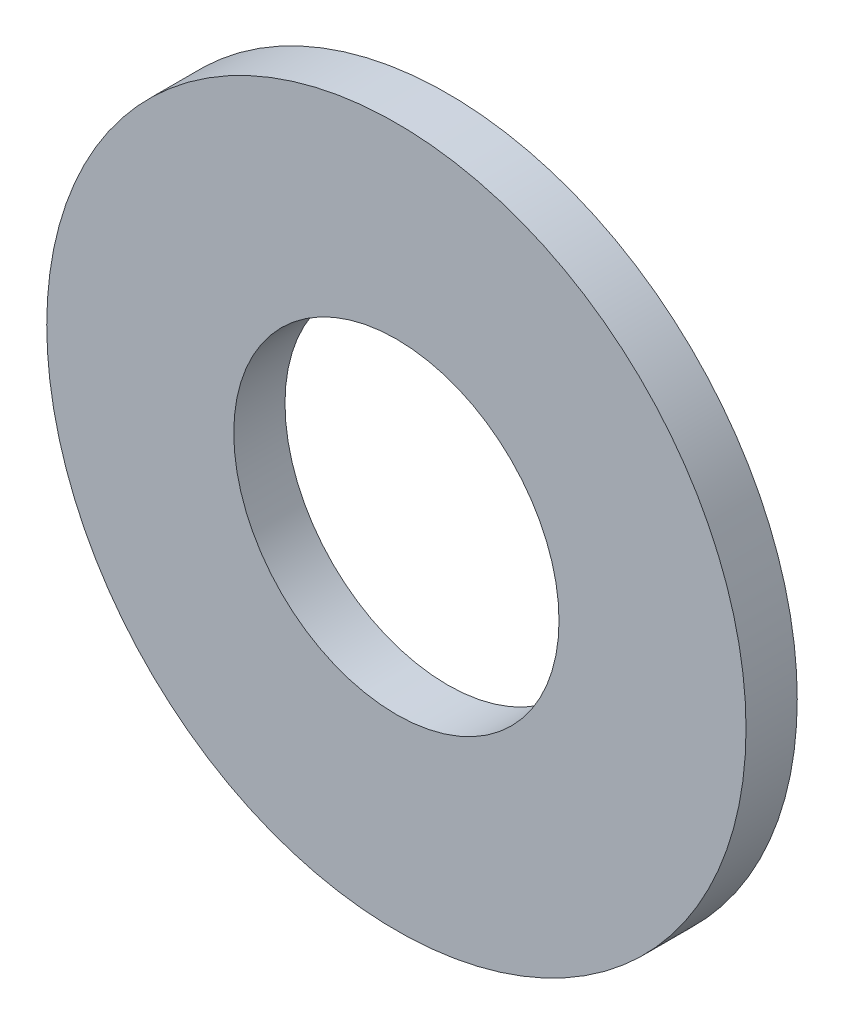
ISO-10303-21;
HEADER;
FILE_DESCRIPTION(('STEP AP214'),'2;1');
FILE_NAME('part.step','',(''),(''),'','','');
FILE_SCHEMA(('AUTOMOTIVE_DESIGN { 1 0 10303 214 1 1 1 1 }'));
ENDSEC;
DATA;
#1=APPLICATION_CONTEXT('core data for automotive mechanical design processes');
#2=APPLICATION_PROTOCOL_DEFINITION('international standard','automotive_design',2000,#1);
#3=PRODUCT_CONTEXT('',#1,'mechanical');
#4=PRODUCT('Part','Part','',(#3));
#5=PRODUCT_RELATED_PRODUCT_CATEGORY('part','',(#4));
#6=PRODUCT_DEFINITION_FORMATION('','',#4);
#7=PRODUCT_DEFINITION_CONTEXT('part definition',#1,'design');
#8=PRODUCT_DEFINITION('design','',#6,#7);
#9=PRODUCT_DEFINITION_SHAPE('','',#8);
#10=(LENGTH_UNIT() NAMED_UNIT(*) SI_UNIT(.MILLI.,.METRE.));
#11=(NAMED_UNIT(*) PLANE_ANGLE_UNIT() SI_UNIT($,.RADIAN.));
#12=(NAMED_UNIT(*) SI_UNIT($,.STERADIAN.) SOLID_ANGLE_UNIT());
#13=UNCERTAINTY_MEASURE_WITH_UNIT(LENGTH_MEASURE(1.E-05),#10,'distance_accuracy_value','');
#14=(GEOMETRIC_REPRESENTATION_CONTEXT(3) GLOBAL_UNCERTAINTY_ASSIGNED_CONTEXT((#13)) GLOBAL_UNIT_ASSIGNED_CONTEXT((#10,
#11,#12)) REPRESENTATION_CONTEXT('',''));
#15=CARTESIAN_POINT('',(0.,0.,0.));
#16=DIRECTION('',(0.,0.,1.));
#17=DIRECTION('',(1.,0.,0.));
#18=AXIS2_PLACEMENT_3D('',#15,#16,#17);
#19=CARTESIAN_POINT('',(0.,5.461,0.));
#20=DIRECTION('',(0.,0.,-1.));
#21=DIRECTION('',(-1.,0.,0.));
#22=AXIS2_PLACEMENT_3D('',#19,#20,#21);
#23=PLANE('',#22);
#24=CARTESIAN_POINT('',(0.,0.,0.));
#25=DIRECTION('',(0.,0.,1.));
#26=DIRECTION('',(1.,0.,0.));
#27=AXIS2_PLACEMENT_3D('',#24,#25,#26);
#28=CIRCLE('',#27,2.54);
#29=CARTESIAN_POINT('',(2.54,0.,0.));
#30=VERTEX_POINT('',#29);
#31=EDGE_CURVE('E10',#30,#30,#28,.T.);
#32=ORIENTED_EDGE('',*,*,#31,.F.);
#33=EDGE_LOOP('',(#32));
#34=FACE_BOUND('',#33,.T.);
#35=CARTESIAN_POINT('',(0.,0.,0.));
#36=DIRECTION('',(0.,0.,1.));
#37=DIRECTION('',(1.,0.,0.));
#38=AXIS2_PLACEMENT_3D('',#35,#36,#37);
#39=CIRCLE('',#38,5.461);
#40=CARTESIAN_POINT('',(5.461,0.,0.));
#41=VERTEX_POINT('',#40);
#42=EDGE_CURVE('E47',#41,#41,#39,.T.);
#43=ORIENTED_EDGE('',*,*,#42,.T.);
#44=EDGE_LOOP('',(#43));
#45=FACE_BOUND('',#44,.T.);
#46=ADVANCED_FACE('F33',(#34,#45),#23,.F.);
#47=CARTESIAN_POINT('',(0.,0.,0.));
#48=DIRECTION('',(0.,0.,1.));
#49=DIRECTION('',(1.,0.,0.));
#50=AXIS2_PLACEMENT_3D('',#47,#48,#49);
#51=CYLINDRICAL_SURFACE('',#50,2.54);
#52=CARTESIAN_POINT('',(0.,0.,-0.800100000000001));
#53=DIRECTION('',(0.,0.,1.));
#54=DIRECTION('',(1.,0.,0.));
#55=AXIS2_PLACEMENT_3D('',#52,#53,#54);
#56=CIRCLE('',#55,2.54);
#57=CARTESIAN_POINT('',(2.54,0.,-0.800100000000001));
#58=VERTEX_POINT('',#57);
#59=EDGE_CURVE('E39',#58,#58,#56,.T.);
#60=ORIENTED_EDGE('',*,*,#59,.F.);
#61=EDGE_LOOP('',(#60));
#62=FACE_BOUND('',#61,.T.);
#63=ORIENTED_EDGE('',*,*,#31,.T.);
#64=EDGE_LOOP('',(#63));
#65=FACE_BOUND('',#64,.T.);
#66=ADVANCED_FACE('F62',(#62,#65),#51,.F.);
#67=CARTESIAN_POINT('',(0.,5.461,-0.800100000000001));
#68=DIRECTION('',(0.,0.,1.));
#69=DIRECTION('',(1.,0.,0.));
#70=AXIS2_PLACEMENT_3D('',#67,#68,#69);
#71=PLANE('',#70);
#72=CARTESIAN_POINT('',(0.,0.,-0.800100000000001));
#73=DIRECTION('',(0.,0.,1.));
#74=DIRECTION('',(1.,0.,0.));
#75=AXIS2_PLACEMENT_3D('',#72,#73,#74);
#76=CIRCLE('',#75,5.461);
#77=CARTESIAN_POINT('',(5.461,0.,-0.800100000000001));
#78=VERTEX_POINT('',#77);
#79=EDGE_CURVE('E43',#78,#78,#76,.T.);
#80=ORIENTED_EDGE('',*,*,#79,.F.);
#81=EDGE_LOOP('',(#80));
#82=FACE_BOUND('',#81,.T.);
#83=ORIENTED_EDGE('',*,*,#59,.T.);
#84=EDGE_LOOP('',(#83));
#85=FACE_BOUND('',#84,.T.);
#86=ADVANCED_FACE('F57',(#82,#85),#71,.F.);
#87=CARTESIAN_POINT('',(0.,0.,0.));
#88=DIRECTION('',(0.,0.,1.));
#89=DIRECTION('',(1.,0.,0.));
#90=AXIS2_PLACEMENT_3D('',#87,#88,#89);
#91=CYLINDRICAL_SURFACE('',#90,5.461);
#92=ORIENTED_EDGE('',*,*,#42,.F.);
#93=EDGE_LOOP('',(#92));
#94=FACE_BOUND('',#93,.T.);
#95=ORIENTED_EDGE('',*,*,#79,.T.);
#96=EDGE_LOOP('',(#95));
#97=FACE_BOUND('',#96,.T.);
#98=ADVANCED_FACE('F54',(#94,#97),#91,.T.);
#99=CLOSED_SHELL('',(#46,#66,#86,#98));
#100=MANIFOLD_SOLID_BREP('B2',#99);
#101=ADVANCED_BREP_SHAPE_REPRESENTATION('',(#18,#100),#14);
#102=SHAPE_DEFINITION_REPRESENTATION(#9,#101);
ENDSEC;
END-ISO-10303-21;
